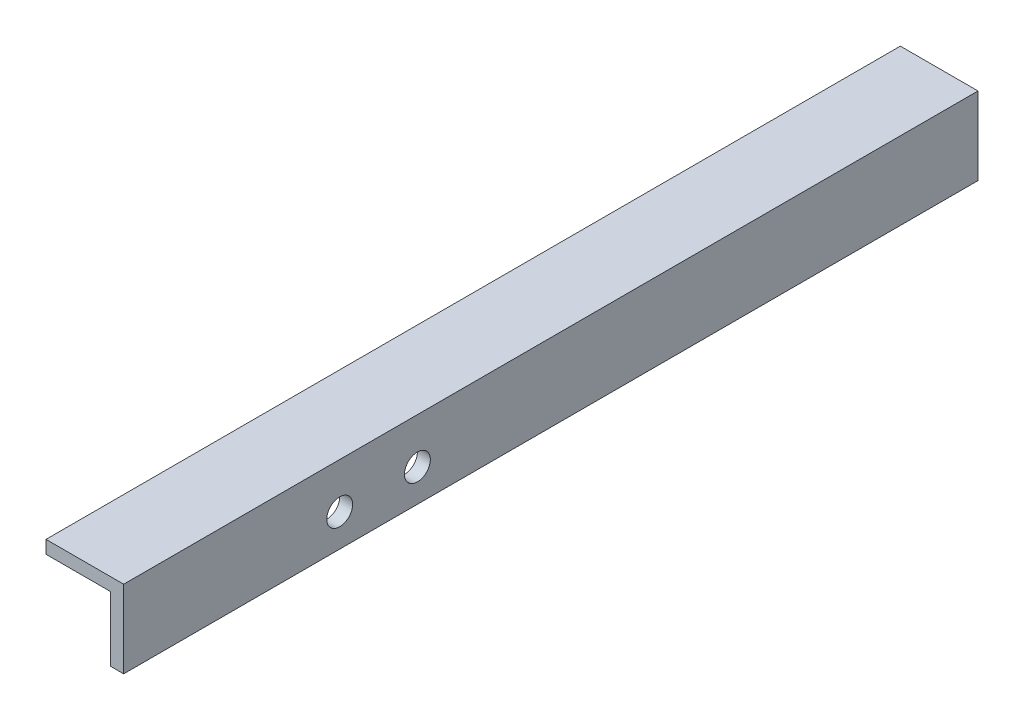
ISO-10303-21;
HEADER;
FILE_DESCRIPTION(('STEP AP214'),'2;1');
FILE_NAME('part.step','',(''),(''),'','','');
FILE_SCHEMA(('AUTOMOTIVE_DESIGN { 1 0 10303 214 1 1 1 1 }'));
ENDSEC;
DATA;
#1=APPLICATION_CONTEXT('core data for automotive mechanical design processes');
#2=APPLICATION_PROTOCOL_DEFINITION('international standard','automotive_design',2000,#1);
#3=PRODUCT_CONTEXT('',#1,'mechanical');
#4=PRODUCT('Part','Part','',(#3));
#5=PRODUCT_RELATED_PRODUCT_CATEGORY('part','',(#4));
#6=PRODUCT_DEFINITION_FORMATION('','',#4);
#7=PRODUCT_DEFINITION_CONTEXT('part definition',#1,'design');
#8=PRODUCT_DEFINITION('design','',#6,#7);
#9=PRODUCT_DEFINITION_SHAPE('','',#8);
#10=(LENGTH_UNIT() NAMED_UNIT(*) SI_UNIT(.MILLI.,.METRE.));
#11=(NAMED_UNIT(*) PLANE_ANGLE_UNIT() SI_UNIT($,.RADIAN.));
#12=(NAMED_UNIT(*) SI_UNIT($,.STERADIAN.) SOLID_ANGLE_UNIT());
#13=UNCERTAINTY_MEASURE_WITH_UNIT(LENGTH_MEASURE(1.E-05),#10,'distance_accuracy_value','');
#14=(GEOMETRIC_REPRESENTATION_CONTEXT(3) GLOBAL_UNCERTAINTY_ASSIGNED_CONTEXT((#13)) GLOBAL_UNIT_ASSIGNED_CONTEXT((#10,
#11,#12)) REPRESENTATION_CONTEXT('',''));
#15=CARTESIAN_POINT('',(0.,0.,0.));
#16=DIRECTION('',(0.,0.,1.));
#17=DIRECTION('',(1.,0.,0.));
#18=AXIS2_PLACEMENT_3D('',#15,#16,#17);
#19=CARTESIAN_POINT('',(-269.875,946.3,269.781536726415));
#20=DIRECTION('',(-1.,0.,0.));
#21=DIRECTION('',(0.,0.,1.));
#22=AXIS2_PLACEMENT_3D('',#19,#20,#21);
#23=PLANE('',#22);
#24=CARTESIAN_POINT('',(-269.875,962.174999999998,71.808874461128));
#25=DIRECTION('',(-1.,0.,0.));
#26=DIRECTION('',(0.,0.,1.));
#27=AXIS2_PLACEMENT_3D('',#24,#25,#26);
#28=CIRCLE('',#27,6.34999999998303);
#29=CARTESIAN_POINT('',(-269.875,962.174999999998,78.1588744611111));
#30=VERTEX_POINT('',#29);
#31=EDGE_CURVE('E176',#30,#30,#28,.T.);
#32=ORIENTED_EDGE('',*,*,#31,.T.);
#33=EDGE_LOOP('',(#32));
#34=FACE_BOUND('',#33,.T.);
#35=CARTESIAN_POINT('',(-269.875,962.174999999998,109.908874461128));
#36=DIRECTION('',(-1.,0.,0.));
#37=DIRECTION('',(0.,0.,1.));
#38=AXIS2_PLACEMENT_3D('',#35,#36,#37);
#39=CIRCLE('',#38,6.34999999998316);
#40=CARTESIAN_POINT('',(-269.875,962.174999999998,116.258874461111));
#41=VERTEX_POINT('',#40);
#42=EDGE_CURVE('E125',#41,#41,#39,.T.);
#43=ORIENTED_EDGE('',*,*,#42,.T.);
#44=EDGE_LOOP('',(#43));
#45=FACE_BOUND('',#44,.T.);
#46=DIRECTION('',(0.,0.,-1.));
#47=VECTOR('',#46,1.);
#48=CARTESIAN_POINT('',(-269.875,984.4,269.781536726415));
#49=LINE('',#48,#47);
#50=CARTESIAN_POINT('',(-269.875,984.4,215.9));
#51=VERTEX_POINT('',#50);
#52=CARTESIAN_POINT('',(-269.875,984.4,-203.2));
#53=VERTEX_POINT('',#52);
#54=EDGE_CURVE('E146',#51,#53,#49,.T.);
#55=ORIENTED_EDGE('',*,*,#54,.F.);
#56=DIRECTION('',(0.,-1.,0.));
#57=VECTOR('',#56,1.);
#58=CARTESIAN_POINT('',(-269.875,946.3,215.9));
#59=LINE('',#58,#57);
#60=CARTESIAN_POINT('',(-269.875,946.3,215.9));
#61=VERTEX_POINT('',#60);
#62=EDGE_CURVE('E43',#51,#61,#59,.T.);
#63=ORIENTED_EDGE('',*,*,#62,.T.);
#64=DIRECTION('',(0.,0.,-1.));
#65=VECTOR('',#64,1.);
#66=CARTESIAN_POINT('',(-269.875,946.3,269.781536726415));
#67=LINE('',#66,#65);
#68=CARTESIAN_POINT('',(-269.875,946.3,-203.2));
#69=VERTEX_POINT('',#68);
#70=EDGE_CURVE('E149',#61,#69,#67,.T.);
#71=ORIENTED_EDGE('',*,*,#70,.T.);
#72=DIRECTION('',(0.,-1.,0.));
#73=VECTOR('',#72,1.);
#74=CARTESIAN_POINT('',(-269.875,946.3,-203.2));
#75=LINE('',#74,#73);
#76=EDGE_CURVE('E168',#53,#69,#75,.T.);
#77=ORIENTED_EDGE('',*,*,#76,.F.);
#78=EDGE_LOOP('',(#55,#63,#71,#77));
#79=FACE_BOUND('',#78,.T.);
#80=ADVANCED_FACE('F39',(#34,#45,#79),#23,.F.);
#81=CARTESIAN_POINT('',(-269.875,946.3,269.781536726415));
#82=DIRECTION('',(0.,-1.,0.));
#83=DIRECTION('',(0.,0.,-1.));
#84=AXIS2_PLACEMENT_3D('',#81,#82,#83);
#85=PLANE('',#84);
#86=DIRECTION('',(1.,0.,0.));
#87=VECTOR('',#86,1.);
#88=CARTESIAN_POINT('',(-269.875,946.3,215.9));
#89=LINE('',#88,#87);
#90=CARTESIAN_POINT('',(-276.225,946.3,215.9));
#91=VERTEX_POINT('',#90);
#92=EDGE_CURVE('E136',#91,#61,#89,.T.);
#93=ORIENTED_EDGE('',*,*,#92,.F.);
#94=DIRECTION('',(0.,0.,-1.));
#95=VECTOR('',#94,1.);
#96=CARTESIAN_POINT('',(-276.225,946.3,269.781536726415));
#97=LINE('',#96,#95);
#98=CARTESIAN_POINT('',(-276.225,946.3,-203.2));
#99=VERTEX_POINT('',#98);
#100=EDGE_CURVE('E152',#91,#99,#97,.T.);
#101=ORIENTED_EDGE('',*,*,#100,.T.);
#102=DIRECTION('',(1.,0.,0.));
#103=VECTOR('',#102,1.);
#104=CARTESIAN_POINT('',(-269.875,946.3,-203.2));
#105=LINE('',#104,#103);
#106=EDGE_CURVE('E170',#99,#69,#105,.T.);
#107=ORIENTED_EDGE('',*,*,#106,.T.);
#108=ORIENTED_EDGE('',*,*,#70,.F.);
#109=EDGE_LOOP('',(#93,#101,#107,#108));
#110=FACE_BOUND('',#109,.T.);
#111=ADVANCED_FACE('F196',(#110),#85,.T.);
#112=CARTESIAN_POINT('',(-276.225,946.3,269.781536726415));
#113=DIRECTION('',(-1.,0.,0.));
#114=DIRECTION('',(0.,0.,1.));
#115=AXIS2_PLACEMENT_3D('',#112,#113,#114);
#116=PLANE('',#115);
#117=CARTESIAN_POINT('',(-276.225,962.174999999998,71.808874461128));
#118=DIRECTION('',(-1.,0.,0.));
#119=DIRECTION('',(0.,0.,1.));
#120=AXIS2_PLACEMENT_3D('',#117,#118,#119);
#121=CIRCLE('',#120,6.34999999998303);
#122=CARTESIAN_POINT('',(-276.225,962.174999999998,78.1588744611111));
#123=VERTEX_POINT('',#122);
#124=EDGE_CURVE('E178',#123,#123,#121,.T.);
#125=ORIENTED_EDGE('',*,*,#124,.F.);
#126=EDGE_LOOP('',(#125));
#127=FACE_BOUND('',#126,.T.);
#128=CARTESIAN_POINT('',(-276.225,962.174999999998,109.908874461128));
#129=DIRECTION('',(-1.,0.,0.));
#130=DIRECTION('',(0.,0.,1.));
#131=AXIS2_PLACEMENT_3D('',#128,#129,#130);
#132=CIRCLE('',#131,6.34999999998316);
#133=CARTESIAN_POINT('',(-276.225,962.174999999998,116.258874461111));
#134=VERTEX_POINT('',#133);
#135=EDGE_CURVE('E130',#134,#134,#132,.T.);
#136=ORIENTED_EDGE('',*,*,#135,.F.);
#137=EDGE_LOOP('',(#136));
#138=FACE_BOUND('',#137,.T.);
#139=DIRECTION('',(0.,-1.,0.));
#140=VECTOR('',#139,1.);
#141=CARTESIAN_POINT('',(-276.225,946.3,215.9));
#142=LINE('',#141,#140);
#143=CARTESIAN_POINT('',(-276.225,978.05,215.9));
#144=VERTEX_POINT('',#143);
#145=EDGE_CURVE('E139',#144,#91,#142,.T.);
#146=ORIENTED_EDGE('',*,*,#145,.F.);
#147=DIRECTION('',(0.,0.,-1.));
#148=VECTOR('',#147,1.);
#149=CARTESIAN_POINT('',(-276.225,978.05,269.781536726415));
#150=LINE('',#149,#148);
#151=CARTESIAN_POINT('',(-276.225,978.05,-203.2));
#152=VERTEX_POINT('',#151);
#153=EDGE_CURVE('E108',#144,#152,#150,.T.);
#154=ORIENTED_EDGE('',*,*,#153,.T.);
#155=DIRECTION('',(0.,-1.,0.));
#156=VECTOR('',#155,1.);
#157=CARTESIAN_POINT('',(-276.225,946.3,-203.2));
#158=LINE('',#157,#156);
#159=EDGE_CURVE('E119',#152,#99,#158,.T.);
#160=ORIENTED_EDGE('',*,*,#159,.T.);
#161=ORIENTED_EDGE('',*,*,#100,.F.);
#162=EDGE_LOOP('',(#146,#154,#160,#161));
#163=FACE_BOUND('',#162,.T.);
#164=ADVANCED_FACE('F193',(#127,#138,#163),#116,.T.);
#165=CARTESIAN_POINT('',(-269.875,978.05,269.781536726415));
#166=DIRECTION('',(0.,-1.,0.));
#167=DIRECTION('',(0.,0.,-1.));
#168=AXIS2_PLACEMENT_3D('',#165,#166,#167);
#169=PLANE('',#168);
#170=DIRECTION('',(1.,0.,0.));
#171=VECTOR('',#170,1.);
#172=CARTESIAN_POINT('',(-269.875,978.05,215.9));
#173=LINE('',#172,#171);
#174=CARTESIAN_POINT('',(-307.975,978.05,215.9));
#175=VERTEX_POINT('',#174);
#176=EDGE_CURVE('E65',#175,#144,#173,.T.);
#177=ORIENTED_EDGE('',*,*,#176,.F.);
#178=DIRECTION('',(0.,0.,-1.));
#179=VECTOR('',#178,1.);
#180=CARTESIAN_POINT('',(-307.975,978.05,269.781536726415));
#181=LINE('',#180,#179);
#182=CARTESIAN_POINT('',(-307.975,978.05,-203.2));
#183=VERTEX_POINT('',#182);
#184=EDGE_CURVE('E100',#175,#183,#181,.T.);
#185=ORIENTED_EDGE('',*,*,#184,.T.);
#186=DIRECTION('',(1.,0.,0.));
#187=VECTOR('',#186,1.);
#188=CARTESIAN_POINT('',(-269.875,978.05,-203.2));
#189=LINE('',#188,#187);
#190=EDGE_CURVE('E103',#183,#152,#189,.T.);
#191=ORIENTED_EDGE('',*,*,#190,.T.);
#192=ORIENTED_EDGE('',*,*,#153,.F.);
#193=EDGE_LOOP('',(#177,#185,#191,#192));
#194=FACE_BOUND('',#193,.T.);
#195=ADVANCED_FACE('F102',(#194),#169,.T.);
#196=CARTESIAN_POINT('',(-307.975,978.05,269.781536726415));
#197=DIRECTION('',(-1.,0.,0.));
#198=DIRECTION('',(0.,0.,1.));
#199=AXIS2_PLACEMENT_3D('',#196,#197,#198);
#200=PLANE('',#199);
#201=DIRECTION('',(0.,-1.,0.));
#202=VECTOR('',#201,1.);
#203=CARTESIAN_POINT('',(-307.975,978.05,215.9));
#204=LINE('',#203,#202);
#205=CARTESIAN_POINT('',(-307.975,984.4,215.9));
#206=VERTEX_POINT('',#205);
#207=EDGE_CURVE('E49',#206,#175,#204,.T.);
#208=ORIENTED_EDGE('',*,*,#207,.F.);
#209=DIRECTION('',(0.,0.,-1.));
#210=VECTOR('',#209,1.);
#211=CARTESIAN_POINT('',(-307.975,984.4,269.781536726415));
#212=LINE('',#211,#210);
#213=CARTESIAN_POINT('',(-307.975,984.4,-203.2));
#214=VERTEX_POINT('',#213);
#215=EDGE_CURVE('E107',#206,#214,#212,.T.);
#216=ORIENTED_EDGE('',*,*,#215,.T.);
#217=DIRECTION('',(0.,-1.,0.));
#218=VECTOR('',#217,1.);
#219=CARTESIAN_POINT('',(-307.975,978.05,-203.2));
#220=LINE('',#219,#218);
#221=EDGE_CURVE('E115',#214,#183,#220,.T.);
#222=ORIENTED_EDGE('',*,*,#221,.T.);
#223=ORIENTED_EDGE('',*,*,#184,.F.);
#224=EDGE_LOOP('',(#208,#216,#222,#223));
#225=FACE_BOUND('',#224,.T.);
#226=ADVANCED_FACE('F122',(#225),#200,.T.);
#227=CARTESIAN_POINT('',(-269.875,984.4,269.781536726415));
#228=DIRECTION('',(0.,-1.,0.));
#229=DIRECTION('',(0.,0.,-1.));
#230=AXIS2_PLACEMENT_3D('',#227,#228,#229);
#231=PLANE('',#230);
#232=ORIENTED_EDGE('',*,*,#215,.F.);
#233=DIRECTION('',(1.,0.,0.));
#234=VECTOR('',#233,1.);
#235=CARTESIAN_POINT('',(-269.875,984.4,215.9));
#236=LINE('',#235,#234);
#237=EDGE_CURVE('E11',#206,#51,#236,.T.);
#238=ORIENTED_EDGE('',*,*,#237,.T.);
#239=ORIENTED_EDGE('',*,*,#54,.T.);
#240=DIRECTION('',(1.,0.,0.));
#241=VECTOR('',#240,1.);
#242=CARTESIAN_POINT('',(-269.875,984.4,-203.2));
#243=LINE('',#242,#241);
#244=EDGE_CURVE('E134',#214,#53,#243,.T.);
#245=ORIENTED_EDGE('',*,*,#244,.F.);
#246=EDGE_LOOP('',(#232,#238,#239,#245));
#247=FACE_BOUND('',#246,.T.);
#248=ADVANCED_FACE('F41',(#247),#231,.F.);
#249=CARTESIAN_POINT('',(-269.875,190.65,215.9));
#250=DIRECTION('',(0.,0.,-1.));
#251=DIRECTION('',(0.,1.,0.));
#252=AXIS2_PLACEMENT_3D('',#249,#250,#251);
#253=PLANE('',#252);
#254=ORIENTED_EDGE('',*,*,#207,.T.);
#255=ORIENTED_EDGE('',*,*,#176,.T.);
#256=ORIENTED_EDGE('',*,*,#145,.T.);
#257=ORIENTED_EDGE('',*,*,#92,.T.);
#258=ORIENTED_EDGE('',*,*,#62,.F.);
#259=ORIENTED_EDGE('',*,*,#237,.F.);
#260=EDGE_LOOP('',(#254,#255,#256,#257,#258,#259));
#261=FACE_BOUND('',#260,.T.);
#262=ADVANCED_FACE('F165',(#261),#253,.F.);
#263=CARTESIAN_POINT('',(-269.875,190.65,-203.2));
#264=DIRECTION('',(0.,0.,1.));
#265=DIRECTION('',(0.,-1.,0.));
#266=AXIS2_PLACEMENT_3D('',#263,#264,#265);
#267=PLANE('',#266);
#268=ORIENTED_EDGE('',*,*,#244,.T.);
#269=ORIENTED_EDGE('',*,*,#76,.T.);
#270=ORIENTED_EDGE('',*,*,#106,.F.);
#271=ORIENTED_EDGE('',*,*,#159,.F.);
#272=ORIENTED_EDGE('',*,*,#190,.F.);
#273=ORIENTED_EDGE('',*,*,#221,.F.);
#274=EDGE_LOOP('',(#268,#269,#270,#271,#272,#273));
#275=FACE_BOUND('',#274,.T.);
#276=ADVANCED_FACE('F114',(#275),#267,.F.);
#277=CARTESIAN_POINT('',(-269.875,962.174999999998,109.908874461128));
#278=DIRECTION('',(-1.,0.,0.));
#279=DIRECTION('',(0.,0.,1.));
#280=AXIS2_PLACEMENT_3D('',#277,#278,#279);
#281=CYLINDRICAL_SURFACE('',#280,6.34999999998316);
#282=ORIENTED_EDGE('',*,*,#42,.F.);
#283=EDGE_LOOP('',(#282));
#284=FACE_BOUND('',#283,.T.);
#285=ORIENTED_EDGE('',*,*,#135,.T.);
#286=EDGE_LOOP('',(#285));
#287=FACE_BOUND('',#286,.T.);
#288=ADVANCED_FACE('F189',(#284,#287),#281,.F.);
#289=CARTESIAN_POINT('',(-269.875,962.174999999998,71.808874461128));
#290=DIRECTION('',(-1.,0.,0.));
#291=DIRECTION('',(0.,0.,1.));
#292=AXIS2_PLACEMENT_3D('',#289,#290,#291);
#293=CYLINDRICAL_SURFACE('',#292,6.34999999998303);
#294=ORIENTED_EDGE('',*,*,#31,.F.);
#295=EDGE_LOOP('',(#294));
#296=FACE_BOUND('',#295,.T.);
#297=ORIENTED_EDGE('',*,*,#124,.T.);
#298=EDGE_LOOP('',(#297));
#299=FACE_BOUND('',#298,.T.);
#300=ADVANCED_FACE('F186',(#296,#299),#293,.F.);
#301=CLOSED_SHELL('',(#80,#111,#164,#195,#226,#248,#262,#276,#288,#300));
#302=MANIFOLD_SOLID_BREP('B2',#301);
#303=ADVANCED_BREP_SHAPE_REPRESENTATION('',(#18,#302),#14);
#304=SHAPE_DEFINITION_REPRESENTATION(#9,#303);
ENDSEC;
END-ISO-10303-21;
